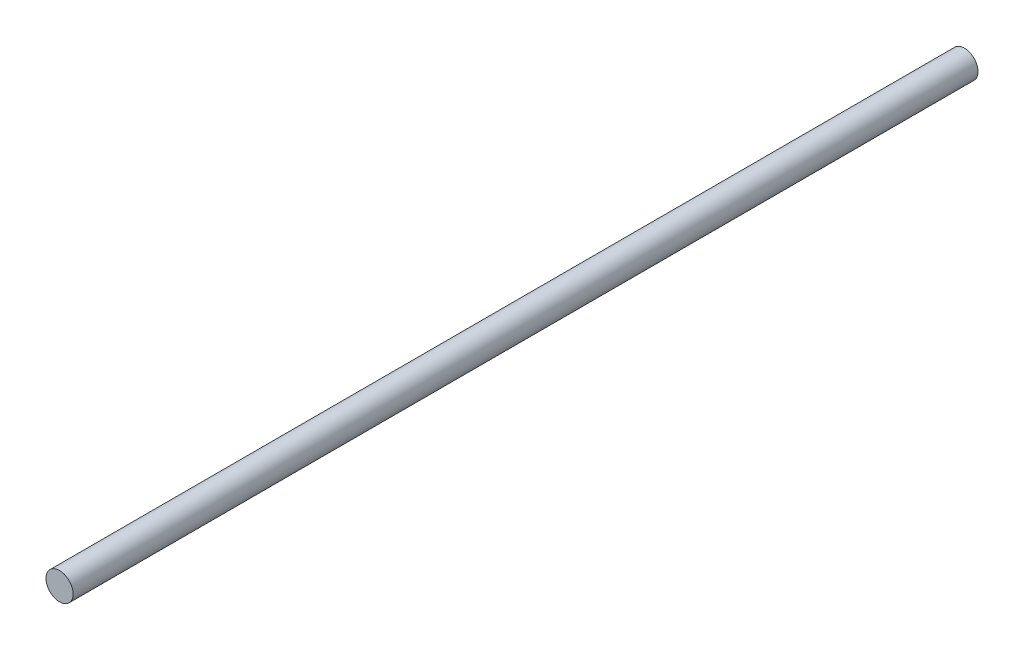
ISO-10303-21;
HEADER;
FILE_DESCRIPTION(('STEP AP214'),'2;1');
FILE_NAME('part.step','',(''),(''),'','','');
FILE_SCHEMA(('AUTOMOTIVE_DESIGN { 1 0 10303 214 1 1 1 1 }'));
ENDSEC;
DATA;
#1=APPLICATION_CONTEXT('core data for automotive mechanical design processes');
#2=APPLICATION_PROTOCOL_DEFINITION('international standard','automotive_design',2000,#1);
#3=PRODUCT_CONTEXT('',#1,'mechanical');
#4=PRODUCT('Part','Part','',(#3));
#5=PRODUCT_RELATED_PRODUCT_CATEGORY('part','',(#4));
#6=PRODUCT_DEFINITION_FORMATION('','',#4);
#7=PRODUCT_DEFINITION_CONTEXT('part definition',#1,'design');
#8=PRODUCT_DEFINITION('design','',#6,#7);
#9=PRODUCT_DEFINITION_SHAPE('','',#8);
#10=(LENGTH_UNIT() NAMED_UNIT(*) SI_UNIT(.MILLI.,.METRE.));
#11=(NAMED_UNIT(*) PLANE_ANGLE_UNIT() SI_UNIT($,.RADIAN.));
#12=(NAMED_UNIT(*) SI_UNIT($,.STERADIAN.) SOLID_ANGLE_UNIT());
#13=UNCERTAINTY_MEASURE_WITH_UNIT(LENGTH_MEASURE(1.E-05),#10,'distance_accuracy_value','');
#14=(GEOMETRIC_REPRESENTATION_CONTEXT(3) GLOBAL_UNCERTAINTY_ASSIGNED_CONTEXT((#13)) GLOBAL_UNIT_ASSIGNED_CONTEXT((#10,
#11,#12)) REPRESENTATION_CONTEXT('',''));
#15=CARTESIAN_POINT('',(0.,0.,0.));
#16=DIRECTION('',(0.,0.,1.));
#17=DIRECTION('',(1.,0.,0.));
#18=AXIS2_PLACEMENT_3D('',#15,#16,#17);
#19=CARTESIAN_POINT('',(0.,0.,-100.));
#20=DIRECTION('',(0.,0.,1.));
#21=DIRECTION('',(1.,0.,0.));
#22=AXIS2_PLACEMENT_3D('',#19,#20,#21);
#23=CYLINDRICAL_SURFACE('',#22,3.);
#24=CARTESIAN_POINT('',(0.,0.,-100.));
#25=DIRECTION('',(0.,0.,1.));
#26=DIRECTION('',(1.,0.,0.));
#27=AXIS2_PLACEMENT_3D('',#24,#25,#26);
#28=CIRCLE('',#27,3.);
#29=CARTESIAN_POINT('',(3.,0.,-100.));
#30=VERTEX_POINT('',#29);
#31=EDGE_CURVE('E10',#30,#30,#28,.T.);
#32=ORIENTED_EDGE('',*,*,#31,.T.);
#33=EDGE_LOOP('',(#32));
#34=FACE_BOUND('',#33,.T.);
#35=CARTESIAN_POINT('',(0.,0.,100.));
#36=DIRECTION('',(0.,0.,1.));
#37=DIRECTION('',(1.,0.,0.));
#38=AXIS2_PLACEMENT_3D('',#35,#36,#37);
#39=CIRCLE('',#38,3.);
#40=CARTESIAN_POINT('',(3.,0.,100.));
#41=VERTEX_POINT('',#40);
#42=EDGE_CURVE('E39',#41,#41,#39,.T.);
#43=ORIENTED_EDGE('',*,*,#42,.F.);
#44=EDGE_LOOP('',(#43));
#45=FACE_BOUND('',#44,.T.);
#46=ADVANCED_FACE('F33',(#34,#45),#23,.T.);
#47=CARTESIAN_POINT('',(0.,0.,-100.));
#48=DIRECTION('',(0.,0.,1.));
#49=DIRECTION('',(1.,0.,0.));
#50=AXIS2_PLACEMENT_3D('',#47,#48,#49);
#51=PLANE('',#50);
#52=ORIENTED_EDGE('',*,*,#31,.F.);
#53=EDGE_LOOP('',(#52));
#54=FACE_BOUND('',#53,.T.);
#55=ADVANCED_FACE('F48',(#54),#51,.F.);
#56=CARTESIAN_POINT('',(0.,0.,100.));
#57=DIRECTION('',(0.,0.,1.));
#58=DIRECTION('',(1.,0.,0.));
#59=AXIS2_PLACEMENT_3D('',#56,#57,#58);
#60=PLANE('',#59);
#61=ORIENTED_EDGE('',*,*,#42,.T.);
#62=EDGE_LOOP('',(#61));
#63=FACE_BOUND('',#62,.T.);
#64=ADVANCED_FACE('F45',(#63),#60,.T.);
#65=CLOSED_SHELL('',(#46,#55,#64));
#66=MANIFOLD_SOLID_BREP('B2',#65);
#67=ADVANCED_BREP_SHAPE_REPRESENTATION('',(#18,#66),#14);
#68=SHAPE_DEFINITION_REPRESENTATION(#9,#67);
ENDSEC;
END-ISO-10303-21;
